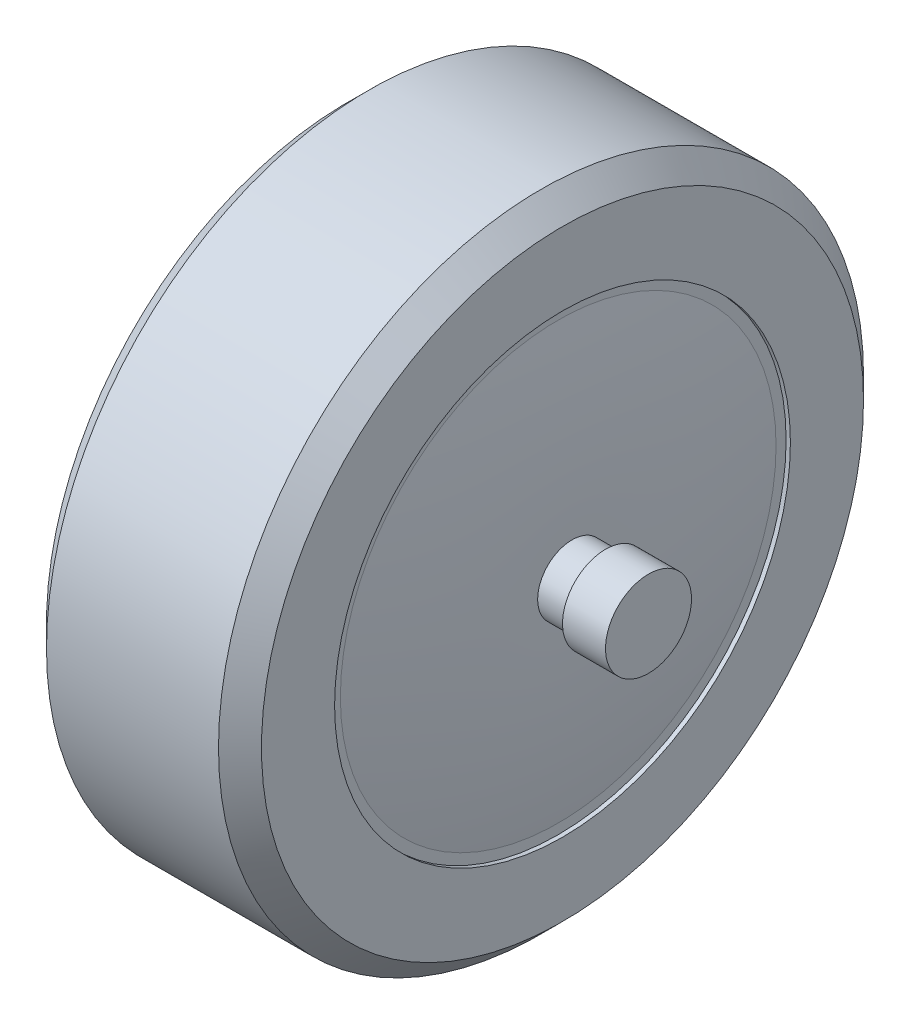
ISO-10303-21;
HEADER;
FILE_DESCRIPTION(('STEP AP214'),'2;1');
FILE_NAME('part.step','',(''),(''),'','','');
FILE_SCHEMA(('AUTOMOTIVE_DESIGN { 1 0 10303 214 1 1 1 1 }'));
ENDSEC;
DATA;
#1=APPLICATION_CONTEXT('core data for automotive mechanical design processes');
#2=APPLICATION_PROTOCOL_DEFINITION('international standard','automotive_design',2000,#1);
#3=PRODUCT_CONTEXT('',#1,'mechanical');
#4=PRODUCT('Part','Part','',(#3));
#5=PRODUCT_RELATED_PRODUCT_CATEGORY('part','',(#4));
#6=PRODUCT_DEFINITION_FORMATION('','',#4);
#7=PRODUCT_DEFINITION_CONTEXT('part definition',#1,'design');
#8=PRODUCT_DEFINITION('design','',#6,#7);
#9=PRODUCT_DEFINITION_SHAPE('','',#8);
#10=(LENGTH_UNIT() NAMED_UNIT(*) SI_UNIT(.MILLI.,.METRE.));
#11=(NAMED_UNIT(*) PLANE_ANGLE_UNIT() SI_UNIT($,.RADIAN.));
#12=(NAMED_UNIT(*) SI_UNIT($,.STERADIAN.) SOLID_ANGLE_UNIT());
#13=UNCERTAINTY_MEASURE_WITH_UNIT(LENGTH_MEASURE(1.E-05),#10,'distance_accuracy_value','');
#14=(GEOMETRIC_REPRESENTATION_CONTEXT(3) GLOBAL_UNCERTAINTY_ASSIGNED_CONTEXT((#13)) GLOBAL_UNIT_ASSIGNED_CONTEXT((#10,
#11,#12)) REPRESENTATION_CONTEXT('',''));
#15=CARTESIAN_POINT('',(0.,0.,0.));
#16=DIRECTION('',(0.,0.,1.));
#17=DIRECTION('',(1.,0.,0.));
#18=AXIS2_PLACEMENT_3D('',#15,#16,#17);
#19=CARTESIAN_POINT('',(-25.,0.,0.));
#20=DIRECTION('',(1.,0.,0.));
#21=DIRECTION('',(0.,0.,-1.));
#22=AXIS2_PLACEMENT_3D('',#19,#20,#21);
#23=PLANE('',#22);
#24=CARTESIAN_POINT('',(-25.,0.,0.));
#25=DIRECTION('',(1.,0.,0.));
#26=DIRECTION('',(0.,0.,-1.));
#27=AXIS2_PLACEMENT_3D('',#24,#25,#26);
#28=CIRCLE('',#27,70.);
#29=CARTESIAN_POINT('',(-25.,0.,-70.));
#30=VERTEX_POINT('',#29);
#31=EDGE_CURVE('E52',#30,#30,#28,.F.);
#32=ORIENTED_EDGE('',*,*,#31,.T.);
#33=EDGE_LOOP('',(#32));
#34=FACE_BOUND('',#33,.T.);
#35=CARTESIAN_POINT('',(-25.,0.,0.));
#36=DIRECTION('',(1.,0.,0.));
#37=DIRECTION('',(0.,0.,-1.));
#38=AXIS2_PLACEMENT_3D('',#35,#36,#37);
#39=CIRCLE('',#38,53.);
#40=CARTESIAN_POINT('',(-25.,0.,-53.));
#41=VERTEX_POINT('',#40);
#42=EDGE_CURVE('E88',#41,#41,#39,.T.);
#43=ORIENTED_EDGE('',*,*,#42,.T.);
#44=EDGE_LOOP('',(#43));
#45=FACE_BOUND('',#44,.T.);
#46=ADVANCED_FACE('F37',(#34,#45),#23,.F.);
#47=CARTESIAN_POINT('',(25.,0.,0.));
#48=DIRECTION('',(-1.,0.,0.));
#49=DIRECTION('',(0.,0.,1.));
#50=AXIS2_PLACEMENT_3D('',#47,#48,#49);
#51=CYLINDRICAL_SURFACE('',#50,75.);
#52=CARTESIAN_POINT('',(-20.,0.,0.));
#53=DIRECTION('',(1.,0.,0.));
#54=DIRECTION('',(0.,0.,-1.));
#55=AXIS2_PLACEMENT_3D('',#52,#53,#54);
#56=CIRCLE('',#55,75.);
#57=CARTESIAN_POINT('',(-20.,0.,-75.));
#58=VERTEX_POINT('',#57);
#59=EDGE_CURVE('E57',#58,#58,#56,.T.);
#60=ORIENTED_EDGE('',*,*,#59,.T.);
#61=EDGE_LOOP('',(#60));
#62=FACE_BOUND('',#61,.T.);
#63=CARTESIAN_POINT('',(20.,0.,0.));
#64=DIRECTION('',(1.,0.,0.));
#65=DIRECTION('',(0.,0.,-1.));
#66=AXIS2_PLACEMENT_3D('',#63,#64,#65);
#67=CIRCLE('',#66,75.);
#68=CARTESIAN_POINT('',(20.,0.,-75.));
#69=VERTEX_POINT('',#68);
#70=EDGE_CURVE('E60',#69,#69,#67,.F.);
#71=ORIENTED_EDGE('',*,*,#70,.T.);
#72=EDGE_LOOP('',(#71));
#73=FACE_BOUND('',#72,.T.);
#74=ADVANCED_FACE('F161',(#62,#73),#51,.T.);
#75=CARTESIAN_POINT('',(25.,0.,0.));
#76=DIRECTION('',(1.,0.,0.));
#77=DIRECTION('',(0.,0.,-1.));
#78=AXIS2_PLACEMENT_3D('',#75,#76,#77);
#79=PLANE('',#78);
#80=CARTESIAN_POINT('',(25.,0.,0.));
#81=DIRECTION('',(1.,0.,0.));
#82=DIRECTION('',(0.,0.,-1.));
#83=AXIS2_PLACEMENT_3D('',#80,#81,#82);
#84=CIRCLE('',#83,53.);
#85=CARTESIAN_POINT('',(25.,0.,-53.));
#86=VERTEX_POINT('',#85);
#87=EDGE_CURVE('E82',#86,#86,#84,.T.);
#88=ORIENTED_EDGE('',*,*,#87,.F.);
#89=EDGE_LOOP('',(#88));
#90=FACE_BOUND('',#89,.T.);
#91=CARTESIAN_POINT('',(25.,0.,0.));
#92=DIRECTION('',(1.,0.,0.));
#93=DIRECTION('',(0.,0.,-1.));
#94=AXIS2_PLACEMENT_3D('',#91,#92,#93);
#95=CIRCLE('',#94,70.);
#96=CARTESIAN_POINT('',(25.,0.,-70.));
#97=VERTEX_POINT('',#96);
#98=EDGE_CURVE('E48',#97,#97,#95,.T.);
#99=ORIENTED_EDGE('',*,*,#98,.T.);
#100=EDGE_LOOP('',(#99));
#101=FACE_BOUND('',#100,.T.);
#102=ADVANCED_FACE('F157',(#90,#101),#79,.T.);
#103=CARTESIAN_POINT('',(-20.,0.,0.));
#104=DIRECTION('',(1.,0.,0.));
#105=DIRECTION('',(0.,0.,-1.));
#106=AXIS2_PLACEMENT_3D('',#103,#104,#105);
#107=CONICAL_SURFACE('',#106,75.,0.785398163397451);
#108=ORIENTED_EDGE('',*,*,#31,.F.);
#109=EDGE_LOOP('',(#108));
#110=FACE_BOUND('',#109,.T.);
#111=ORIENTED_EDGE('',*,*,#59,.F.);
#112=EDGE_LOOP('',(#111));
#113=FACE_BOUND('',#112,.T.);
#114=ADVANCED_FACE('F160',(#110,#113),#107,.T.);
#115=CARTESIAN_POINT('',(25.,0.,0.));
#116=DIRECTION('',(-1.,0.,0.));
#117=DIRECTION('',(0.,0.,1.));
#118=AXIS2_PLACEMENT_3D('',#115,#116,#117);
#119=CONICAL_SURFACE('',#118,70.,0.785398163397448);
#120=ORIENTED_EDGE('',*,*,#70,.F.);
#121=EDGE_LOOP('',(#120));
#122=FACE_BOUND('',#121,.T.);
#123=ORIENTED_EDGE('',*,*,#98,.F.);
#124=EDGE_LOOP('',(#123));
#125=FACE_BOUND('',#124,.T.);
#126=ADVANCED_FACE('F39',(#122,#125),#119,.T.);
#127=CARTESIAN_POINT('',(24.,0.,0.));
#128=DIRECTION('',(1.,0.,0.));
#129=DIRECTION('',(0.,0.,-1.));
#130=AXIS2_PLACEMENT_3D('',#127,#128,#129);
#131=CYLINDRICAL_SURFACE('',#130,53.);
#132=CARTESIAN_POINT('',(24.,0.,0.));
#133=DIRECTION('',(1.,0.,0.));
#134=DIRECTION('',(0.,0.,-1.));
#135=AXIS2_PLACEMENT_3D('',#132,#133,#134);
#136=CIRCLE('',#135,53.);
#137=CARTESIAN_POINT('',(24.,0.,-53.));
#138=VERTEX_POINT('',#137);
#139=EDGE_CURVE('E79',#138,#138,#136,.T.);
#140=ORIENTED_EDGE('',*,*,#139,.F.);
#141=EDGE_LOOP('',(#140));
#142=FACE_BOUND('',#141,.T.);
#143=ORIENTED_EDGE('',*,*,#87,.T.);
#144=EDGE_LOOP('',(#143));
#145=FACE_BOUND('',#144,.T.);
#146=ADVANCED_FACE('F124',(#142,#145),#131,.F.);
#147=CARTESIAN_POINT('',(24.,0.,0.));
#148=DIRECTION('',(1.,0.,0.));
#149=DIRECTION('',(0.,0.,-1.));
#150=AXIS2_PLACEMENT_3D('',#147,#148,#149);
#151=PLANE('',#150);
#152=CARTESIAN_POINT('',(24.,0.,0.));
#153=DIRECTION('',(-1.,0.,0.));
#154=DIRECTION('',(0.,0.,1.));
#155=AXIS2_PLACEMENT_3D('',#152,#153,#154);
#156=CIRCLE('',#155,50.6611661778371);
#157=CARTESIAN_POINT('',(24.,0.,50.6611661778371));
#158=VERTEX_POINT('',#157);
#159=EDGE_CURVE('E91',#158,#158,#156,.T.);
#160=ORIENTED_EDGE('',*,*,#159,.T.);
#161=EDGE_LOOP('',(#160));
#162=FACE_BOUND('',#161,.T.);
#163=ORIENTED_EDGE('',*,*,#139,.T.);
#164=EDGE_LOOP('',(#163));
#165=FACE_BOUND('',#164,.T.);
#166=ADVANCED_FACE('F117',(#162,#165),#151,.T.);
#167=CARTESIAN_POINT('',(-24.,0.,0.));
#168=DIRECTION('',(-1.,0.,0.));
#169=DIRECTION('',(0.,0.,-1.));
#170=AXIS2_PLACEMENT_3D('',#167,#168,#169);
#171=PLANE('',#170);
#172=CARTESIAN_POINT('',(-24.,0.,0.));
#173=DIRECTION('',(-1.,0.,0.));
#174=DIRECTION('',(0.,0.,1.));
#175=AXIS2_PLACEMENT_3D('',#172,#173,#174);
#176=CIRCLE('',#175,50.6611661778371);
#177=CARTESIAN_POINT('',(-24.,0.,50.6611661778371));
#178=VERTEX_POINT('',#177);
#179=EDGE_CURVE('E96',#178,#178,#176,.T.);
#180=ORIENTED_EDGE('',*,*,#179,.F.);
#181=EDGE_LOOP('',(#180));
#182=FACE_BOUND('',#181,.T.);
#183=CARTESIAN_POINT('',(-24.,0.,0.));
#184=DIRECTION('',(1.,0.,0.));
#185=DIRECTION('',(0.,0.,-1.));
#186=AXIS2_PLACEMENT_3D('',#183,#184,#185);
#187=CIRCLE('',#186,53.);
#188=CARTESIAN_POINT('',(-24.,0.,-53.));
#189=VERTEX_POINT('',#188);
#190=EDGE_CURVE('E85',#189,#189,#187,.T.);
#191=ORIENTED_EDGE('',*,*,#190,.F.);
#192=EDGE_LOOP('',(#191));
#193=FACE_BOUND('',#192,.T.);
#194=ADVANCED_FACE('F114',(#182,#193),#171,.T.);
#195=CARTESIAN_POINT('',(-24.,0.,0.));
#196=DIRECTION('',(-1.,0.,0.));
#197=DIRECTION('',(0.,0.,1.));
#198=AXIS2_PLACEMENT_3D('',#195,#196,#197);
#199=CYLINDRICAL_SURFACE('',#198,53.);
#200=ORIENTED_EDGE('',*,*,#190,.T.);
#201=EDGE_LOOP('',(#200));
#202=FACE_BOUND('',#201,.T.);
#203=ORIENTED_EDGE('',*,*,#42,.F.);
#204=EDGE_LOOP('',(#203));
#205=FACE_BOUND('',#204,.T.);
#206=ADVANCED_FACE('F111',(#202,#205),#199,.F.);
#207=CARTESIAN_POINT('',(27.,0.,0.));
#208=CARTESIAN_POINT('',(28.0995961935109,0.,-25.4639231277384));
#209=CARTESIAN_POINT('',(24.,0.,-50.6611661778371));
#210=B_SPLINE_CURVE_WITH_KNOTS('',2,(#207,#208,#209),.UNSPECIFIED.,.F.,.F.,(3,3),(0.,1.),.UNSPECIFIED.);
#211=CARTESIAN_POINT('',(27.,0.,0.));
#212=DIRECTION('',(-1.,0.,0.));
#213=AXIS1_PLACEMENT('',#211,#212);
#214=SURFACE_OF_REVOLUTION('',#210,#213);
#215=ORIENTED_EDGE('',*,*,#159,.F.);
#216=EDGE_LOOP('',(#215));
#217=FACE_BOUND('',#216,.T.);
#218=CARTESIAN_POINT('',(27.217239567852,0.,0.));
#219=DIRECTION('',(-1.,0.,0.));
#220=DIRECTION('',(0.,0.,1.));
#221=AXIS2_PLACEMENT_3D('',#218,#219,#220);
#222=CIRCLE('',#221,8.);
#223=CARTESIAN_POINT('',(27.217239567852,0.,8.));
#224=VERTEX_POINT('',#223);
#225=EDGE_CURVE('E44',#224,#224,#222,.T.);
#226=ORIENTED_EDGE('',*,*,#225,.T.);
#227=EDGE_LOOP('',(#226));
#228=FACE_BOUND('',#227,.T.);
#229=ADVANCED_FACE('F106',(#217,#228),#214,.T.);
#230=CARTESIAN_POINT('',(45.,0.,0.));
#231=DIRECTION('',(1.,0.,0.));
#232=DIRECTION('',(0.,0.,-1.));
#233=AXIS2_PLACEMENT_3D('',#230,#231,#232);
#234=PLANE('',#233);
#235=CARTESIAN_POINT('',(45.,0.,0.));
#236=DIRECTION('',(1.,0.,0.));
#237=DIRECTION('',(0.,0.,-1.));
#238=AXIS2_PLACEMENT_3D('',#235,#236,#237);
#239=CIRCLE('',#238,10.);
#240=CARTESIAN_POINT('',(45.,0.,-10.));
#241=VERTEX_POINT('',#240);
#242=EDGE_CURVE('E71',#241,#241,#239,.T.);
#243=ORIENTED_EDGE('',*,*,#242,.T.);
#244=EDGE_LOOP('',(#243));
#245=FACE_BOUND('',#244,.T.);
#246=ADVANCED_FACE('F110',(#245),#234,.T.);
#247=CARTESIAN_POINT('',(45.,0.,0.));
#248=DIRECTION('',(-1.,0.,0.));
#249=DIRECTION('',(0.,0.,1.));
#250=AXIS2_PLACEMENT_3D('',#247,#248,#249);
#251=CYLINDRICAL_SURFACE('',#250,10.);
#252=ORIENTED_EDGE('',*,*,#242,.F.);
#253=EDGE_LOOP('',(#252));
#254=FACE_BOUND('',#253,.T.);
#255=CARTESIAN_POINT('',(35.,0.,0.));
#256=DIRECTION('',(1.,0.,0.));
#257=DIRECTION('',(0.,0.,-1.));
#258=AXIS2_PLACEMENT_3D('',#255,#256,#257);
#259=CIRCLE('',#258,10.);
#260=CARTESIAN_POINT('',(35.,0.,-10.));
#261=VERTEX_POINT('',#260);
#262=EDGE_CURVE('E67',#261,#261,#259,.T.);
#263=ORIENTED_EDGE('',*,*,#262,.T.);
#264=EDGE_LOOP('',(#263));
#265=FACE_BOUND('',#264,.T.);
#266=ADVANCED_FACE('F144',(#254,#265),#251,.T.);
#267=CARTESIAN_POINT('',(35.,0.,0.));
#268=DIRECTION('',(1.,0.,0.));
#269=DIRECTION('',(0.,0.,-1.));
#270=AXIS2_PLACEMENT_3D('',#267,#268,#269);
#271=PLANE('',#270);
#272=CARTESIAN_POINT('',(35.,0.,0.));
#273=DIRECTION('',(1.,0.,0.));
#274=DIRECTION('',(0.,0.,-1.));
#275=AXIS2_PLACEMENT_3D('',#272,#273,#274);
#276=CIRCLE('',#275,8.);
#277=CARTESIAN_POINT('',(35.,0.,-8.));
#278=VERTEX_POINT('',#277);
#279=EDGE_CURVE('E63',#278,#278,#276,.T.);
#280=ORIENTED_EDGE('',*,*,#279,.T.);
#281=EDGE_LOOP('',(#280));
#282=FACE_BOUND('',#281,.T.);
#283=ORIENTED_EDGE('',*,*,#262,.F.);
#284=EDGE_LOOP('',(#283));
#285=FACE_BOUND('',#284,.T.);
#286=ADVANCED_FACE('F146',(#282,#285),#271,.F.);
#287=CARTESIAN_POINT('',(35.,0.,0.));
#288=DIRECTION('',(-1.,0.,0.));
#289=DIRECTION('',(0.,0.,1.));
#290=AXIS2_PLACEMENT_3D('',#287,#288,#289);
#291=CYLINDRICAL_SURFACE('',#290,8.);
#292=ORIENTED_EDGE('',*,*,#279,.F.);
#293=EDGE_LOOP('',(#292));
#294=FACE_BOUND('',#293,.T.);
#295=ORIENTED_EDGE('',*,*,#225,.F.);
#296=EDGE_LOOP('',(#295));
#297=FACE_BOUND('',#296,.T.);
#298=ADVANCED_FACE('F149',(#294,#297),#291,.T.);
#299=CARTESIAN_POINT('',(-27.,0.,0.));
#300=CARTESIAN_POINT('',(-28.0995961935109,0.,-25.4639231277384));
#301=CARTESIAN_POINT('',(-24.,0.,-50.6611661778371));
#302=B_SPLINE_CURVE_WITH_KNOTS('',2,(#299,#300,#301),.UNSPECIFIED.,.F.,.F.,(3,3),(0.,1.),.UNSPECIFIED.);
#303=CARTESIAN_POINT('',(-27.,0.,0.));
#304=DIRECTION('',(1.,0.,0.));
#305=AXIS1_PLACEMENT('',#303,#304);
#306=SURFACE_OF_REVOLUTION('',#302,#305);
#307=ORIENTED_EDGE('',*,*,#179,.T.);
#308=EDGE_LOOP('',(#307));
#309=FACE_BOUND('',#308,.T.);
#310=CARTESIAN_POINT('',(-27.217239567852,0.,0.));
#311=DIRECTION('',(1.,0.,0.));
#312=DIRECTION('',(0.,0.,-1.));
#313=AXIS2_PLACEMENT_3D('',#310,#311,#312);
#314=CIRCLE('',#313,8.);
#315=CARTESIAN_POINT('',(-27.217239567852,0.,-8.));
#316=VERTEX_POINT('',#315);
#317=EDGE_CURVE('E10',#316,#316,#314,.T.);
#318=ORIENTED_EDGE('',*,*,#317,.T.);
#319=EDGE_LOOP('',(#318));
#320=FACE_BOUND('',#319,.T.);
#321=ADVANCED_FACE('F113',(#309,#320),#306,.T.);
#322=CARTESIAN_POINT('',(-45.,0.,0.));
#323=DIRECTION('',(-1.,0.,0.));
#324=DIRECTION('',(0.,0.,-1.));
#325=AXIS2_PLACEMENT_3D('',#322,#323,#324);
#326=PLANE('',#325);
#327=CARTESIAN_POINT('',(-45.,0.,0.));
#328=DIRECTION('',(1.,0.,0.));
#329=DIRECTION('',(0.,0.,-1.));
#330=AXIS2_PLACEMENT_3D('',#327,#328,#329);
#331=CIRCLE('',#330,10.);
#332=CARTESIAN_POINT('',(-45.,0.,-10.));
#333=VERTEX_POINT('',#332);
#334=EDGE_CURVE('E68',#333,#333,#331,.T.);
#335=ORIENTED_EDGE('',*,*,#334,.F.);
#336=EDGE_LOOP('',(#335));
#337=FACE_BOUND('',#336,.T.);
#338=ADVANCED_FACE('F129',(#337),#326,.T.);
#339=CARTESIAN_POINT('',(-45.,0.,0.));
#340=DIRECTION('',(1.,0.,0.));
#341=DIRECTION('',(0.,0.,-1.));
#342=AXIS2_PLACEMENT_3D('',#339,#340,#341);
#343=CYLINDRICAL_SURFACE('',#342,10.);
#344=ORIENTED_EDGE('',*,*,#334,.T.);
#345=EDGE_LOOP('',(#344));
#346=FACE_BOUND('',#345,.T.);
#347=CARTESIAN_POINT('',(-35.,0.,0.));
#348=DIRECTION('',(1.,0.,0.));
#349=DIRECTION('',(0.,0.,-1.));
#350=AXIS2_PLACEMENT_3D('',#347,#348,#349);
#351=CIRCLE('',#350,10.);
#352=CARTESIAN_POINT('',(-35.,0.,-10.));
#353=VERTEX_POINT('',#352);
#354=EDGE_CURVE('E76',#353,#353,#351,.T.);
#355=ORIENTED_EDGE('',*,*,#354,.F.);
#356=EDGE_LOOP('',(#355));
#357=FACE_BOUND('',#356,.T.);
#358=ADVANCED_FACE('F132',(#346,#357),#343,.T.);
#359=CARTESIAN_POINT('',(-35.,0.,0.));
#360=DIRECTION('',(-1.,0.,0.));
#361=DIRECTION('',(0.,0.,-1.));
#362=AXIS2_PLACEMENT_3D('',#359,#360,#361);
#363=PLANE('',#362);
#364=CARTESIAN_POINT('',(-35.,0.,0.));
#365=DIRECTION('',(1.,0.,0.));
#366=DIRECTION('',(0.,0.,-1.));
#367=AXIS2_PLACEMENT_3D('',#364,#365,#366);
#368=CIRCLE('',#367,8.);
#369=CARTESIAN_POINT('',(-35.,0.,-8.));
#370=VERTEX_POINT('',#369);
#371=EDGE_CURVE('E64',#370,#370,#368,.T.);
#372=ORIENTED_EDGE('',*,*,#371,.F.);
#373=EDGE_LOOP('',(#372));
#374=FACE_BOUND('',#373,.T.);
#375=ORIENTED_EDGE('',*,*,#354,.T.);
#376=EDGE_LOOP('',(#375));
#377=FACE_BOUND('',#376,.T.);
#378=ADVANCED_FACE('F134',(#374,#377),#363,.F.);
#379=ORIENTED_EDGE('',*,*,#371,.T.);
#380=EDGE_LOOP('',(#379));
#381=FACE_BOUND('',#380,.T.);
#382=ORIENTED_EDGE('',*,*,#317,.F.);
#383=EDGE_LOOP('',(#382));
#384=FACE_BOUND('',#383,.T.);
#385=ADVANCED_FACE('F137',(#381,#384),#291,.T.);
#386=CLOSED_SHELL('',(#46,#74,#102,#114,#126,#146,#166,#194,#206,#229,#246,#266,#286,#298,#321,
#338,#358,#378,#385));
#387=MANIFOLD_SOLID_BREP('B2',#386);
#388=ADVANCED_BREP_SHAPE_REPRESENTATION('',(#18,#387),#14);
#389=SHAPE_DEFINITION_REPRESENTATION(#9,#388);
ENDSEC;
END-ISO-10303-21;
